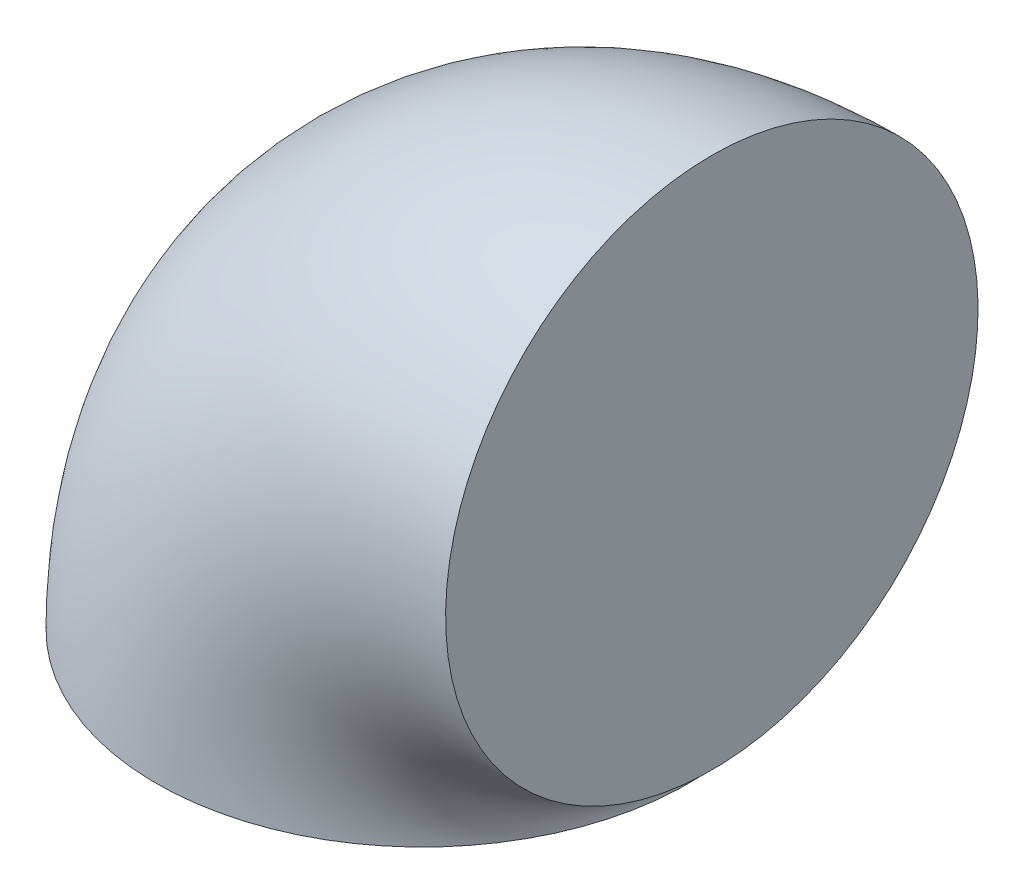
ISO-10303-21;
HEADER;
FILE_DESCRIPTION(('STEP AP214'),'2;1');
FILE_NAME('part.step','',(''),(''),'','','');
FILE_SCHEMA(('AUTOMOTIVE_DESIGN { 1 0 10303 214 1 1 1 1 }'));
ENDSEC;
DATA;
#1=APPLICATION_CONTEXT('core data for automotive mechanical design processes');
#2=APPLICATION_PROTOCOL_DEFINITION('international standard','automotive_design',2000,#1);
#3=PRODUCT_CONTEXT('',#1,'mechanical');
#4=PRODUCT('Part','Part','',(#3));
#5=PRODUCT_RELATED_PRODUCT_CATEGORY('part','',(#4));
#6=PRODUCT_DEFINITION_FORMATION('','',#4);
#7=PRODUCT_DEFINITION_CONTEXT('part definition',#1,'design');
#8=PRODUCT_DEFINITION('design','',#6,#7);
#9=PRODUCT_DEFINITION_SHAPE('','',#8);
#10=(LENGTH_UNIT() NAMED_UNIT(*) SI_UNIT(.MILLI.,.METRE.));
#11=(NAMED_UNIT(*) PLANE_ANGLE_UNIT() SI_UNIT($,.RADIAN.));
#12=(NAMED_UNIT(*) SI_UNIT($,.STERADIAN.) SOLID_ANGLE_UNIT());
#13=UNCERTAINTY_MEASURE_WITH_UNIT(LENGTH_MEASURE(1.E-05),#10,'distance_accuracy_value','');
#14=(GEOMETRIC_REPRESENTATION_CONTEXT(3) GLOBAL_UNCERTAINTY_ASSIGNED_CONTEXT((#13)) GLOBAL_UNIT_ASSIGNED_CONTEXT((#10,
#11,#12)) REPRESENTATION_CONTEXT('',''));
#15=CARTESIAN_POINT('',(0.,0.,0.));
#16=DIRECTION('',(0.,0.,1.));
#17=DIRECTION('',(1.,0.,0.));
#18=AXIS2_PLACEMENT_3D('',#15,#16,#17);
#19=CARTESIAN_POINT('',(53.8,0.,0.));
#20=DIRECTION('',(0.,0.,1.));
#21=DIRECTION('',(1.,0.,0.));
#22=AXIS2_PLACEMENT_3D('',#19,#20,#21);
#23=TOROIDAL_SURFACE('',#22,53.8,49.5);
#24=CARTESIAN_POINT('',(53.8000000000002,53.8,0.));
#25=DIRECTION('',(1.,0.,0.));
#26=DIRECTION('',(0.,0.,1.));
#27=AXIS2_PLACEMENT_3D('',#24,#25,#26);
#28=CIRCLE('',#27,49.5);
#29=CARTESIAN_POINT('',(53.8000000000004,103.3,0.));
#30=VERTEX_POINT('',#29);
#31=EDGE_CURVE('E10',#30,#30,#28,.T.);
#32=CARTESIAN_POINT('',(0.,0.,0.));
#33=DIRECTION('',(0.,1.,0.));
#34=DIRECTION('',(0.,0.,1.));
#35=AXIS2_PLACEMENT_3D('',#32,#33,#34);
#36=CIRCLE('',#35,49.5);
#37=CARTESIAN_POINT('',(-49.5,0.,0.));
#38=VERTEX_POINT('',#37);
#39=EDGE_CURVE('E43',#38,#38,#36,.T.);
#40=CARTESIAN_POINT('',(53.8,0.,0.));
#41=DIRECTION('',(0.,0.,1.));
#42=DIRECTION('',(1.,0.,0.));
#43=AXIS2_PLACEMENT_3D('',#40,#41,#42);
#44=CIRCLE('',#43,103.3);
#45=EDGE_CURVE('',#30,#38,#44,.T.);
#46=ORIENTED_EDGE('',*,*,#31,.F.);
#47=ORIENTED_EDGE('',*,*,#39,.T.);
#48=ORIENTED_EDGE('',*,*,#45,.T.);
#49=ORIENTED_EDGE('',*,*,#45,.F.);
#50=EDGE_LOOP('',(#46,#48,#47,#49));
#51=FACE_BOUND('',#50,.T.);
#52=ADVANCED_FACE('F37',(#51),#23,.T.);
#53=CARTESIAN_POINT('',(53.8000000000002,53.8,0.));
#54=DIRECTION('',(1.,0.,0.));
#55=DIRECTION('',(0.,0.,1.));
#56=AXIS2_PLACEMENT_3D('',#53,#54,#55);
#57=PLANE('',#56);
#58=ORIENTED_EDGE('',*,*,#31,.T.);
#59=EDGE_LOOP('',(#58));
#60=FACE_BOUND('',#59,.T.);
#61=ADVANCED_FACE('F52',(#60),#57,.T.);
#62=CARTESIAN_POINT('',(0.,0.,0.));
#63=DIRECTION('',(0.,1.,0.));
#64=DIRECTION('',(0.,0.,1.));
#65=AXIS2_PLACEMENT_3D('',#62,#63,#64);
#66=PLANE('',#65);
#67=ORIENTED_EDGE('',*,*,#39,.F.);
#68=EDGE_LOOP('',(#67));
#69=FACE_BOUND('',#68,.T.);
#70=ADVANCED_FACE('F50',(#69),#66,.F.);
#71=CLOSED_SHELL('',(#52,#61,#70));
#72=MANIFOLD_SOLID_BREP('B2',#71);
#73=ADVANCED_BREP_SHAPE_REPRESENTATION('',(#18,#72),#14);
#74=SHAPE_DEFINITION_REPRESENTATION(#9,#73);
ENDSEC;
END-ISO-10303-21;
